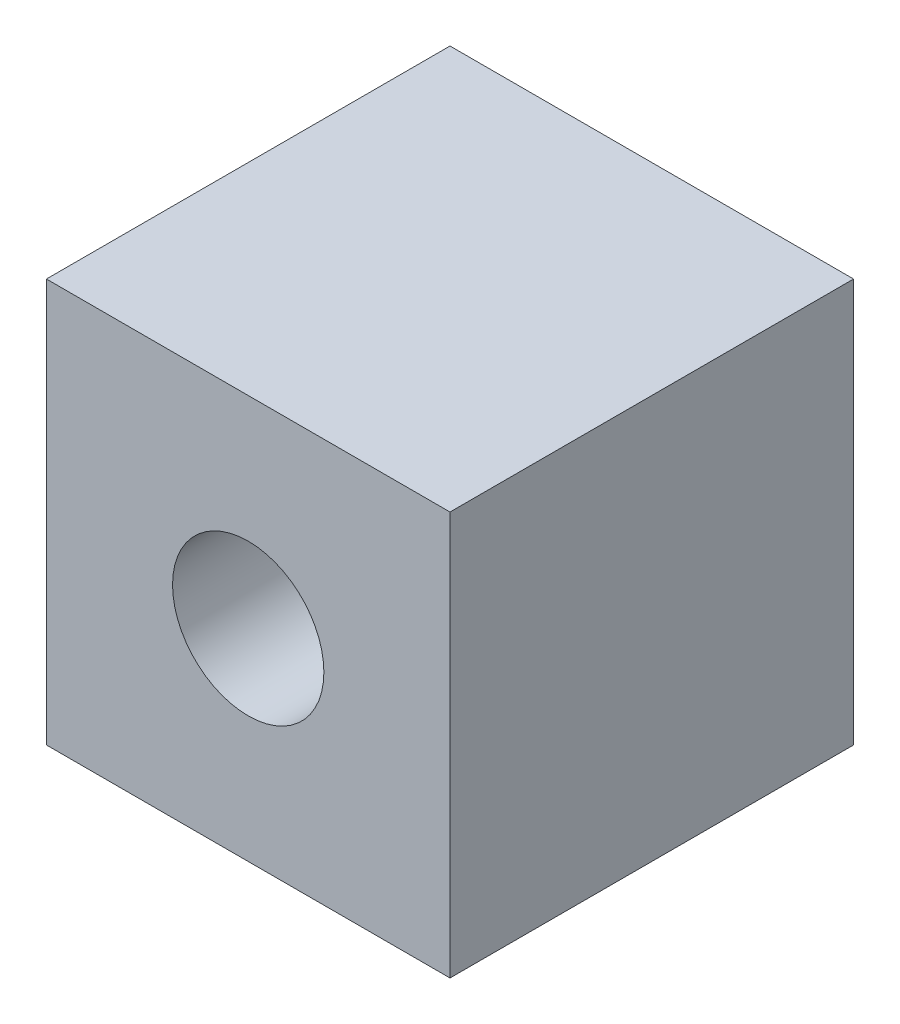
ISO-10303-21;
HEADER;
FILE_DESCRIPTION(('STEP AP214'),'2;1');
FILE_NAME('part.step','',(''),(''),'','','');
FILE_SCHEMA(('AUTOMOTIVE_DESIGN { 1 0 10303 214 1 1 1 1 }'));
ENDSEC;
DATA;
#1=APPLICATION_CONTEXT('core data for automotive mechanical design processes');
#2=APPLICATION_PROTOCOL_DEFINITION('international standard','automotive_design',2000,#1);
#3=PRODUCT_CONTEXT('',#1,'mechanical');
#4=PRODUCT('Part','Part','',(#3));
#5=PRODUCT_RELATED_PRODUCT_CATEGORY('part','',(#4));
#6=PRODUCT_DEFINITION_FORMATION('','',#4);
#7=PRODUCT_DEFINITION_CONTEXT('part definition',#1,'design');
#8=PRODUCT_DEFINITION('design','',#6,#7);
#9=PRODUCT_DEFINITION_SHAPE('','',#8);
#10=(LENGTH_UNIT() NAMED_UNIT(*) SI_UNIT(.MILLI.,.METRE.));
#11=(NAMED_UNIT(*) PLANE_ANGLE_UNIT() SI_UNIT($,.RADIAN.));
#12=(NAMED_UNIT(*) SI_UNIT($,.STERADIAN.) SOLID_ANGLE_UNIT());
#13=UNCERTAINTY_MEASURE_WITH_UNIT(LENGTH_MEASURE(1.E-05),#10,'distance_accuracy_value','');
#14=(GEOMETRIC_REPRESENTATION_CONTEXT(3) GLOBAL_UNCERTAINTY_ASSIGNED_CONTEXT((#13)) GLOBAL_UNIT_ASSIGNED_CONTEXT((#10,
#11,#12)) REPRESENTATION_CONTEXT('',''));
#15=CARTESIAN_POINT('',(0.,0.,0.));
#16=DIRECTION('',(0.,0.,1.));
#17=DIRECTION('',(1.,0.,0.));
#18=AXIS2_PLACEMENT_3D('',#15,#16,#17);
#19=CARTESIAN_POINT('',(-508.001016002032,-508.001016002032,508.));
#20=DIRECTION('',(-1.,0.,0.));
#21=DIRECTION('',(0.,0.,1.));
#22=AXIS2_PLACEMENT_3D('',#19,#20,#21);
#23=PLANE('',#22);
#24=DIRECTION('',(0.,1.,0.));
#25=VECTOR('',#24,1.);
#26=CARTESIAN_POINT('',(-508.001016002032,-508.001016002032,-508.));
#27=LINE('',#26,#25);
#28=CARTESIAN_POINT('',(-508.001016002032,-508.001016002032,-508.));
#29=VERTEX_POINT('',#28);
#30=CARTESIAN_POINT('',(-508.001016002032,508.001016002032,-508.));
#31=VERTEX_POINT('',#30);
#32=EDGE_CURVE('E104',#29,#31,#27,.T.);
#33=ORIENTED_EDGE('',*,*,#32,.F.);
#34=DIRECTION('',(0.,0.,-1.));
#35=VECTOR('',#34,1.);
#36=CARTESIAN_POINT('',(-508.001016002032,-508.001016002032,508.));
#37=LINE('',#36,#35);
#38=CARTESIAN_POINT('',(-508.001016002032,-508.001016002032,508.));
#39=VERTEX_POINT('',#38);
#40=EDGE_CURVE('E11',#39,#29,#37,.T.);
#41=ORIENTED_EDGE('',*,*,#40,.F.);
#42=DIRECTION('',(0.,1.,0.));
#43=VECTOR('',#42,1.);
#44=CARTESIAN_POINT('',(-508.001016002032,-508.001016002032,508.));
#45=LINE('',#44,#43);
#46=CARTESIAN_POINT('',(-508.001016002032,508.001016002032,508.));
#47=VERTEX_POINT('',#46);
#48=EDGE_CURVE('E98',#39,#47,#45,.T.);
#49=ORIENTED_EDGE('',*,*,#48,.T.);
#50=DIRECTION('',(0.,0.,-1.));
#51=VECTOR('',#50,1.);
#52=CARTESIAN_POINT('',(-508.001016002032,508.001016002032,508.));
#53=LINE('',#52,#51);
#54=EDGE_CURVE('E41',#47,#31,#53,.T.);
#55=ORIENTED_EDGE('',*,*,#54,.T.);
#56=EDGE_LOOP('',(#33,#41,#49,#55));
#57=FACE_BOUND('',#56,.T.);
#58=ADVANCED_FACE('F38',(#57),#23,.T.);
#59=CARTESIAN_POINT('',(-508.001016002032,-508.001016002032,508.));
#60=DIRECTION('',(0.,1.,0.));
#61=DIRECTION('',(0.,0.,1.));
#62=AXIS2_PLACEMENT_3D('',#59,#60,#61);
#63=PLANE('',#62);
#64=DIRECTION('',(1.,0.,0.));
#65=VECTOR('',#64,1.);
#66=CARTESIAN_POINT('',(-508.001016002032,-508.001016002032,-508.));
#67=LINE('',#66,#65);
#68=CARTESIAN_POINT('',(508.001016002032,-508.001016002032,-508.));
#69=VERTEX_POINT('',#68);
#70=EDGE_CURVE('E71',#29,#69,#67,.T.);
#71=ORIENTED_EDGE('',*,*,#70,.T.);
#72=DIRECTION('',(0.,0.,-1.));
#73=VECTOR('',#72,1.);
#74=CARTESIAN_POINT('',(508.001016002032,-508.001016002032,508.));
#75=LINE('',#74,#73);
#76=CARTESIAN_POINT('',(508.001016002032,-508.001016002032,508.));
#77=VERTEX_POINT('',#76);
#78=EDGE_CURVE('E47',#77,#69,#75,.T.);
#79=ORIENTED_EDGE('',*,*,#78,.F.);
#80=DIRECTION('',(1.,0.,0.));
#81=VECTOR('',#80,1.);
#82=CARTESIAN_POINT('',(-508.001016002032,-508.001016002032,508.));
#83=LINE('',#82,#81);
#84=EDGE_CURVE('E88',#39,#77,#83,.T.);
#85=ORIENTED_EDGE('',*,*,#84,.F.);
#86=ORIENTED_EDGE('',*,*,#40,.T.);
#87=EDGE_LOOP('',(#71,#79,#85,#86));
#88=FACE_BOUND('',#87,.T.);
#89=ADVANCED_FACE('F115',(#88),#63,.F.);
#90=CARTESIAN_POINT('',(508.001016002032,-508.001016002032,508.));
#91=DIRECTION('',(-1.,0.,0.));
#92=DIRECTION('',(0.,0.,1.));
#93=AXIS2_PLACEMENT_3D('',#90,#91,#92);
#94=PLANE('',#93);
#95=DIRECTION('',(0.,1.,0.));
#96=VECTOR('',#95,1.);
#97=CARTESIAN_POINT('',(508.001016002032,-508.001016002032,-508.));
#98=LINE('',#97,#96);
#99=CARTESIAN_POINT('',(508.001016002032,508.001016002032,-508.));
#100=VERTEX_POINT('',#99);
#101=EDGE_CURVE('E95',#69,#100,#98,.T.);
#102=ORIENTED_EDGE('',*,*,#101,.T.);
#103=DIRECTION('',(0.,0.,-1.));
#104=VECTOR('',#103,1.);
#105=CARTESIAN_POINT('',(508.001016002032,508.001016002032,508.));
#106=LINE('',#105,#104);
#107=CARTESIAN_POINT('',(508.001016002032,508.001016002032,508.));
#108=VERTEX_POINT('',#107);
#109=EDGE_CURVE('E92',#108,#100,#106,.T.);
#110=ORIENTED_EDGE('',*,*,#109,.F.);
#111=DIRECTION('',(0.,1.,0.));
#112=VECTOR('',#111,1.);
#113=CARTESIAN_POINT('',(508.001016002032,-508.001016002032,508.));
#114=LINE('',#113,#112);
#115=EDGE_CURVE('E83',#77,#108,#114,.T.);
#116=ORIENTED_EDGE('',*,*,#115,.F.);
#117=ORIENTED_EDGE('',*,*,#78,.T.);
#118=EDGE_LOOP('',(#102,#110,#116,#117));
#119=FACE_BOUND('',#118,.T.);
#120=ADVANCED_FACE('F93',(#119),#94,.F.);
#121=CARTESIAN_POINT('',(-508.001016002032,508.001016002032,508.));
#122=DIRECTION('',(0.,1.,0.));
#123=DIRECTION('',(0.,0.,1.));
#124=AXIS2_PLACEMENT_3D('',#121,#122,#123);
#125=PLANE('',#124);
#126=DIRECTION('',(1.,0.,0.));
#127=VECTOR('',#126,1.);
#128=CARTESIAN_POINT('',(-508.001016002032,508.001016002032,-508.));
#129=LINE('',#128,#127);
#130=EDGE_CURVE('E107',#31,#100,#129,.T.);
#131=ORIENTED_EDGE('',*,*,#130,.F.);
#132=ORIENTED_EDGE('',*,*,#54,.F.);
#133=DIRECTION('',(1.,0.,0.));
#134=VECTOR('',#133,1.);
#135=CARTESIAN_POINT('',(-508.001016002032,508.001016002032,508.));
#136=LINE('',#135,#134);
#137=EDGE_CURVE('E87',#47,#108,#136,.T.);
#138=ORIENTED_EDGE('',*,*,#137,.T.);
#139=ORIENTED_EDGE('',*,*,#109,.T.);
#140=EDGE_LOOP('',(#131,#132,#138,#139));
#141=FACE_BOUND('',#140,.T.);
#142=ADVANCED_FACE('F97',(#141),#125,.T.);
#143=CARTESIAN_POINT('',(0.,0.,508.));
#144=DIRECTION('',(0.,0.,-1.));
#145=DIRECTION('',(-1.,0.,0.));
#146=AXIS2_PLACEMENT_3D('',#143,#144,#145);
#147=PLANE('',#146);
#148=CARTESIAN_POINT('',(0.,0.,508.));
#149=DIRECTION('',(0.,0.,1.));
#150=DIRECTION('',(1.,0.,0.));
#151=AXIS2_PLACEMENT_3D('',#148,#149,#150);
#152=CIRCLE('',#151,190.500381000762);
#153=CARTESIAN_POINT('',(190.500381000762,0.,508.));
#154=VERTEX_POINT('',#153);
#155=EDGE_CURVE('E146',#154,#154,#152,.T.);
#156=ORIENTED_EDGE('',*,*,#155,.F.);
#157=EDGE_LOOP('',(#156));
#158=FACE_BOUND('',#157,.T.);
#159=ORIENTED_EDGE('',*,*,#48,.F.);
#160=ORIENTED_EDGE('',*,*,#84,.T.);
#161=ORIENTED_EDGE('',*,*,#115,.T.);
#162=ORIENTED_EDGE('',*,*,#137,.F.);
#163=EDGE_LOOP('',(#159,#160,#161,#162));
#164=FACE_BOUND('',#163,.T.);
#165=ADVANCED_FACE('F86',(#158,#164),#147,.F.);
#166=CARTESIAN_POINT('',(0.,0.,-508.));
#167=DIRECTION('',(0.,0.,-1.));
#168=DIRECTION('',(-1.,0.,0.));
#169=AXIS2_PLACEMENT_3D('',#166,#167,#168);
#170=PLANE('',#169);
#171=CARTESIAN_POINT('',(0.,0.,-508.));
#172=DIRECTION('',(0.,0.,1.));
#173=DIRECTION('',(1.,0.,0.));
#174=AXIS2_PLACEMENT_3D('',#171,#172,#173);
#175=CIRCLE('',#174,190.500381000762);
#176=CARTESIAN_POINT('',(190.500381000762,0.,-508.));
#177=VERTEX_POINT('',#176);
#178=EDGE_CURVE('E108',#177,#177,#175,.T.);
#179=ORIENTED_EDGE('',*,*,#178,.T.);
#180=EDGE_LOOP('',(#179));
#181=FACE_BOUND('',#180,.T.);
#182=ORIENTED_EDGE('',*,*,#32,.T.);
#183=ORIENTED_EDGE('',*,*,#130,.T.);
#184=ORIENTED_EDGE('',*,*,#101,.F.);
#185=ORIENTED_EDGE('',*,*,#70,.F.);
#186=EDGE_LOOP('',(#182,#183,#184,#185));
#187=FACE_BOUND('',#186,.T.);
#188=ADVANCED_FACE('F113',(#181,#187),#170,.T.);
#189=CARTESIAN_POINT('',(0.,0.,-508.));
#190=DIRECTION('',(0.,0.,1.));
#191=DIRECTION('',(1.,0.,0.));
#192=AXIS2_PLACEMENT_3D('',#189,#190,#191);
#193=CYLINDRICAL_SURFACE('',#192,190.500381000762);
#194=ORIENTED_EDGE('',*,*,#178,.F.);
#195=EDGE_LOOP('',(#194));
#196=FACE_BOUND('',#195,.T.);
#197=ORIENTED_EDGE('',*,*,#155,.T.);
#198=EDGE_LOOP('',(#197));
#199=FACE_BOUND('',#198,.T.);
#200=ADVANCED_FACE('F134',(#196,#199),#193,.F.);
#201=CLOSED_SHELL('',(#58,#89,#120,#142,#165,#188,#200));
#202=MANIFOLD_SOLID_BREP('B2',#201);
#203=ADVANCED_BREP_SHAPE_REPRESENTATION('',(#18,#202),#14);
#204=SHAPE_DEFINITION_REPRESENTATION(#9,#203);
ENDSEC;
END-ISO-10303-21;
